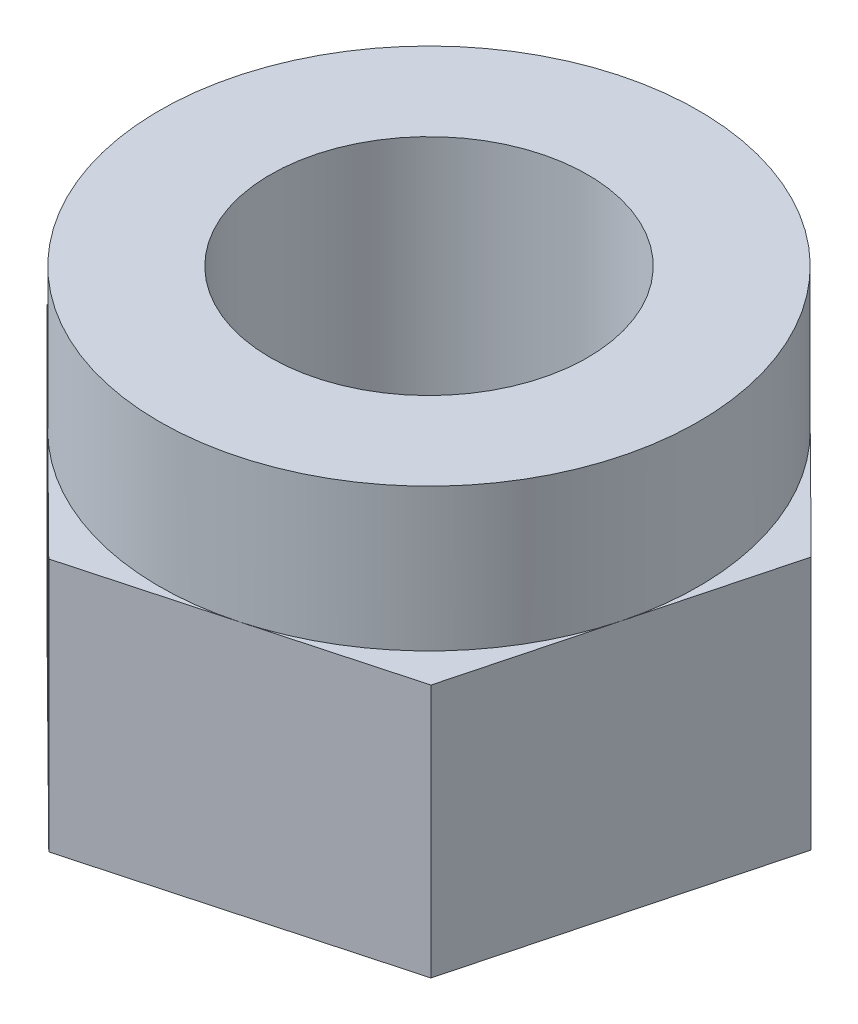
ISO-10303-21;
HEADER;
FILE_DESCRIPTION(('STEP AP214'),'2;1');
FILE_NAME('part.step','',(''),(''),'','','');
FILE_SCHEMA(('AUTOMOTIVE_DESIGN { 1 0 10303 214 1 1 1 1 }'));
ENDSEC;
DATA;
#1=APPLICATION_CONTEXT('core data for automotive mechanical design processes');
#2=APPLICATION_PROTOCOL_DEFINITION('international standard','automotive_design',2000,#1);
#3=PRODUCT_CONTEXT('',#1,'mechanical');
#4=PRODUCT('Part','Part','',(#3));
#5=PRODUCT_RELATED_PRODUCT_CATEGORY('part','',(#4));
#6=PRODUCT_DEFINITION_FORMATION('','',#4);
#7=PRODUCT_DEFINITION_CONTEXT('part definition',#1,'design');
#8=PRODUCT_DEFINITION('design','',#6,#7);
#9=PRODUCT_DEFINITION_SHAPE('','',#8);
#10=(LENGTH_UNIT() NAMED_UNIT(*) SI_UNIT(.MILLI.,.METRE.));
#11=(NAMED_UNIT(*) PLANE_ANGLE_UNIT() SI_UNIT($,.RADIAN.));
#12=(NAMED_UNIT(*) SI_UNIT($,.STERADIAN.) SOLID_ANGLE_UNIT());
#13=UNCERTAINTY_MEASURE_WITH_UNIT(LENGTH_MEASURE(1.E-05),#10,'distance_accuracy_value','');
#14=(GEOMETRIC_REPRESENTATION_CONTEXT(3) GLOBAL_UNCERTAINTY_ASSIGNED_CONTEXT((#13)) GLOBAL_UNIT_ASSIGNED_CONTEXT((#10,
#11,#12)) REPRESENTATION_CONTEXT('',''));
#15=CARTESIAN_POINT('',(0.,0.,0.));
#16=DIRECTION('',(0.,0.,1.));
#17=DIRECTION('',(1.,0.,0.));
#18=AXIS2_PLACEMENT_3D('',#15,#16,#17);
#19=CARTESIAN_POINT('',(0.,3.2,0.));
#20=DIRECTION('',(0.,1.,0.));
#21=DIRECTION('',(0.,0.,1.));
#22=AXIS2_PLACEMENT_3D('',#19,#20,#21);
#23=PLANE('',#22);
#24=DIRECTION('',(0.710289508724359,0.,0.70390966309329));
#25=VECTOR('',#24,1.);
#26=CARTESIAN_POINT('',(-2.39329285451718,3.2,2.41498432966281));
#27=LINE('',#26,#25);
#28=CARTESIAN_POINT('',(-3.78758470733673,3.2,1.03321605585771));
#29=VERTEX_POINT('',#28);
#30=CARTESIAN_POINT('',(-2.39329285451718,3.2,2.41498432966281));
#31=VERTEX_POINT('',#30);
#32=EDGE_CURVE('E113',#29,#31,#27,.T.);
#33=ORIENTED_EDGE('',*,*,#32,.T.);
#34=CARTESIAN_POINT('',(0.,3.2,0.));
#35=DIRECTION('',(0.,1.,0.));
#36=DIRECTION('',(0.,0.,1.));
#37=AXIS2_PLACEMENT_3D('',#34,#35,#36);
#38=CIRCLE('',#37,3.4);
#39=CARTESIAN_POINT('',(-3.28808420648792,3.2,-0.865160245876246));
#40=VERTEX_POINT('',#39);
#41=EDGE_CURVE('E51',#31,#40,#38,.F.);
#42=ORIENTED_EDGE('',*,*,#41,.T.);
#43=DIRECTION('',(-0.254458895845956,0.,0.967083590143508));
#44=VECTOR('',#43,1.);
#45=CARTESIAN_POINT('',(-3.28808420648792,3.2,-0.865160245876246));
#46=LINE('',#45,#44);
#47=EDGE_CURVE('E110',#40,#29,#46,.T.);
#48=ORIENTED_EDGE('',*,*,#47,.T.);
#49=EDGE_LOOP('',(#33,#42,#48));
#50=FACE_BOUND('',#49,.T.);
#51=ADVANCED_FACE('F36',(#50),#23,.T.);
#52=CARTESIAN_POINT('',(-2.7885837056391,3.2,-2.7635365476102));
#53=VERTEX_POINT('',#52);
#54=EDGE_CURVE('E117',#53,#40,#46,.T.);
#55=ORIENTED_EDGE('',*,*,#54,.T.);
#56=CARTESIAN_POINT('',(-0.894791351970739,3.2,-3.28014457553906));
#57=VERTEX_POINT('',#56);
#58=EDGE_CURVE('E187',#40,#57,#38,.F.);
#59=ORIENTED_EDGE('',*,*,#58,.T.);
#60=DIRECTION('',(-0.964748404570314,0.,0.263173927050218));
#61=VECTOR('',#60,1.);
#62=CARTESIAN_POINT('',(-0.894791351970738,3.2,-3.28014457553906));
#63=LINE('',#62,#61);
#64=EDGE_CURVE('E202',#57,#53,#63,.T.);
#65=ORIENTED_EDGE('',*,*,#64,.T.);
#66=EDGE_LOOP('',(#55,#59,#65));
#67=FACE_BOUND('',#66,.T.);
#68=ADVANCED_FACE('F204',(#67),#23,.T.);
#69=CARTESIAN_POINT('',(0.999001001697629,3.2,-3.79675260346791));
#70=VERTEX_POINT('',#69);
#71=EDGE_CURVE('E118',#70,#57,#63,.T.);
#72=ORIENTED_EDGE('',*,*,#71,.T.);
#73=CARTESIAN_POINT('',(2.39329285451718,3.2,-2.41498432966281));
#74=VERTEX_POINT('',#73);
#75=EDGE_CURVE('E185',#57,#74,#38,.F.);
#76=ORIENTED_EDGE('',*,*,#75,.T.);
#77=DIRECTION('',(-0.710289508724359,0.,-0.70390966309329));
#78=VECTOR('',#77,1.);
#79=CARTESIAN_POINT('',(2.39329285451718,3.2,-2.41498432966281));
#80=LINE('',#79,#78);
#81=EDGE_CURVE('E200',#74,#70,#80,.T.);
#82=ORIENTED_EDGE('',*,*,#81,.T.);
#83=EDGE_LOOP('',(#72,#76,#82));
#84=FACE_BOUND('',#83,.T.);
#85=ADVANCED_FACE('F206',(#84),#23,.T.);
#86=CARTESIAN_POINT('',(3.78758470733673,3.2,-1.03321605585771));
#87=VERTEX_POINT('',#86);
#88=EDGE_CURVE('E201',#87,#74,#80,.T.);
#89=ORIENTED_EDGE('',*,*,#88,.T.);
#90=CARTESIAN_POINT('',(3.28808420648792,3.2,0.865160245876247));
#91=VERTEX_POINT('',#90);
#92=EDGE_CURVE('E192',#74,#91,#38,.F.);
#93=ORIENTED_EDGE('',*,*,#92,.T.);
#94=DIRECTION('',(0.254458895845956,0.,-0.967083590143508));
#95=VECTOR('',#94,1.);
#96=CARTESIAN_POINT('',(3.28808420648792,3.2,0.865160245876247));
#97=LINE('',#96,#95);
#98=EDGE_CURVE('E97',#91,#87,#97,.T.);
#99=ORIENTED_EDGE('',*,*,#98,.T.);
#100=EDGE_LOOP('',(#89,#93,#99));
#101=FACE_BOUND('',#100,.T.);
#102=ADVANCED_FACE('F212',(#101),#23,.T.);
#103=CARTESIAN_POINT('',(2.78858370563911,3.2,2.76353654761021));
#104=VERTEX_POINT('',#103);
#105=EDGE_CURVE('E198',#104,#91,#97,.T.);
#106=ORIENTED_EDGE('',*,*,#105,.T.);
#107=CARTESIAN_POINT('',(0.89479135197074,3.2,3.28014457553906));
#108=VERTEX_POINT('',#107);
#109=EDGE_CURVE('E195',#91,#108,#38,.F.);
#110=ORIENTED_EDGE('',*,*,#109,.T.);
#111=DIRECTION('',(0.964748404570314,0.,-0.263173927050218));
#112=VECTOR('',#111,1.);
#113=CARTESIAN_POINT('',(0.89479135197074,3.2,3.28014457553906));
#114=LINE('',#113,#112);
#115=EDGE_CURVE('E60',#108,#104,#114,.T.);
#116=ORIENTED_EDGE('',*,*,#115,.T.);
#117=EDGE_LOOP('',(#106,#110,#116));
#118=FACE_BOUND('',#117,.T.);
#119=ADVANCED_FACE('F216',(#118),#23,.T.);
#120=CARTESIAN_POINT('',(3.28808420648792,3.2,0.865160245876247));
#121=DIRECTION('',(-0.967083590143508,0.,-0.254458895845955));
#122=DIRECTION('',(-0.254458895845956,0.,0.967083590143508));
#123=AXIS2_PLACEMENT_3D('',#120,#121,#122);
#124=PLANE('',#123);
#125=DIRECTION('',(0.254458895845956,0.,-0.967083590143508));
#126=VECTOR('',#125,1.);
#127=CARTESIAN_POINT('',(3.28808420648792,0.,0.865160245876247));
#128=LINE('',#127,#126);
#129=CARTESIAN_POINT('',(2.78858370563911,0.,2.76353654761021));
#130=VERTEX_POINT('',#129);
#131=CARTESIAN_POINT('',(3.78758470733673,0.,-1.03321605585771));
#132=VERTEX_POINT('',#131);
#133=EDGE_CURVE('E142',#130,#132,#128,.T.);
#134=ORIENTED_EDGE('',*,*,#133,.T.);
#135=DIRECTION('',(0.,-1.,0.));
#136=VECTOR('',#135,1.);
#137=CARTESIAN_POINT('',(3.78758470733673,3.2,-1.03321605585771));
#138=LINE('',#137,#136);
#139=EDGE_CURVE('E11',#87,#132,#138,.T.);
#140=ORIENTED_EDGE('',*,*,#139,.F.);
#141=ORIENTED_EDGE('',*,*,#98,.F.);
#142=ORIENTED_EDGE('',*,*,#105,.F.);
#143=DIRECTION('',(0.,-1.,0.));
#144=VECTOR('',#143,1.);
#145=CARTESIAN_POINT('',(2.78858370563911,3.2,2.76353654761021));
#146=LINE('',#145,#144);
#147=EDGE_CURVE('E141',#104,#130,#146,.T.);
#148=ORIENTED_EDGE('',*,*,#147,.T.);
#149=EDGE_LOOP('',(#134,#140,#141,#142,#148));
#150=FACE_BOUND('',#149,.T.);
#151=ADVANCED_FACE('F38',(#150),#124,.F.);
#152=CARTESIAN_POINT('',(2.39329285451718,3.2,-2.41498432966281));
#153=DIRECTION('',(-0.70390966309329,0.,0.710289508724359));
#154=DIRECTION('',(0.710289508724359,0.,0.70390966309329));
#155=AXIS2_PLACEMENT_3D('',#152,#153,#154);
#156=PLANE('',#155);
#157=DIRECTION('',(-0.710289508724359,0.,-0.70390966309329));
#158=VECTOR('',#157,1.);
#159=CARTESIAN_POINT('',(2.39329285451718,0.,-2.41498432966281));
#160=LINE('',#159,#158);
#161=CARTESIAN_POINT('',(0.999001001697629,0.,-3.79675260346791));
#162=VERTEX_POINT('',#161);
#163=EDGE_CURVE('E144',#132,#162,#160,.T.);
#164=ORIENTED_EDGE('',*,*,#163,.T.);
#165=DIRECTION('',(0.,-1.,0.));
#166=VECTOR('',#165,1.);
#167=CARTESIAN_POINT('',(0.999001001697629,3.2,-3.79675260346791));
#168=LINE('',#167,#166);
#169=EDGE_CURVE('E44',#70,#162,#168,.T.);
#170=ORIENTED_EDGE('',*,*,#169,.F.);
#171=ORIENTED_EDGE('',*,*,#81,.F.);
#172=ORIENTED_EDGE('',*,*,#88,.F.);
#173=ORIENTED_EDGE('',*,*,#139,.T.);
#174=EDGE_LOOP('',(#164,#170,#171,#172,#173));
#175=FACE_BOUND('',#174,.T.);
#176=ADVANCED_FACE('F228',(#175),#156,.F.);
#177=CARTESIAN_POINT('',(-0.894791351970738,3.2,-3.28014457553906));
#178=DIRECTION('',(0.263173927050218,0.,0.964748404570314));
#179=DIRECTION('',(0.964748404570314,0.,-0.263173927050218));
#180=AXIS2_PLACEMENT_3D('',#177,#178,#179);
#181=PLANE('',#180);
#182=DIRECTION('',(-0.964748404570314,0.,0.263173927050218));
#183=VECTOR('',#182,1.);
#184=CARTESIAN_POINT('',(-0.894791351970738,0.,-3.28014457553906));
#185=LINE('',#184,#183);
#186=CARTESIAN_POINT('',(-2.7885837056391,0.,-2.7635365476102));
#187=VERTEX_POINT('',#186);
#188=EDGE_CURVE('E146',#162,#187,#185,.T.);
#189=ORIENTED_EDGE('',*,*,#188,.T.);
#190=DIRECTION('',(0.,-1.,0.));
#191=VECTOR('',#190,1.);
#192=CARTESIAN_POINT('',(-2.7885837056391,3.2,-2.7635365476102));
#193=LINE('',#192,#191);
#194=EDGE_CURVE('E128',#53,#187,#193,.T.);
#195=ORIENTED_EDGE('',*,*,#194,.F.);
#196=ORIENTED_EDGE('',*,*,#64,.F.);
#197=ORIENTED_EDGE('',*,*,#71,.F.);
#198=ORIENTED_EDGE('',*,*,#169,.T.);
#199=EDGE_LOOP('',(#189,#195,#196,#197,#198));
#200=FACE_BOUND('',#199,.T.);
#201=ADVANCED_FACE('F159',(#200),#181,.F.);
#202=CARTESIAN_POINT('',(-3.28808420648792,3.2,-0.865160245876246));
#203=DIRECTION('',(0.967083590143508,0.,0.254458895845955));
#204=DIRECTION('',(0.254458895845956,0.,-0.967083590143508));
#205=AXIS2_PLACEMENT_3D('',#202,#203,#204);
#206=PLANE('',#205);
#207=DIRECTION('',(-0.254458895845956,0.,0.967083590143508));
#208=VECTOR('',#207,1.);
#209=CARTESIAN_POINT('',(-3.28808420648792,0.,-0.865160245876246));
#210=LINE('',#209,#208);
#211=CARTESIAN_POINT('',(-3.78758470733673,0.,1.03321605585771));
#212=VERTEX_POINT('',#211);
#213=EDGE_CURVE('E125',#187,#212,#210,.T.);
#214=ORIENTED_EDGE('',*,*,#213,.T.);
#215=DIRECTION('',(0.,-1.,0.));
#216=VECTOR('',#215,1.);
#217=CARTESIAN_POINT('',(-3.78758470733673,3.2,1.03321605585771));
#218=LINE('',#217,#216);
#219=EDGE_CURVE('E121',#29,#212,#218,.T.);
#220=ORIENTED_EDGE('',*,*,#219,.F.);
#221=ORIENTED_EDGE('',*,*,#47,.F.);
#222=ORIENTED_EDGE('',*,*,#54,.F.);
#223=ORIENTED_EDGE('',*,*,#194,.T.);
#224=EDGE_LOOP('',(#214,#220,#221,#222,#223));
#225=FACE_BOUND('',#224,.T.);
#226=ADVANCED_FACE('F122',(#225),#206,.F.);
#227=CARTESIAN_POINT('',(-2.39329285451718,3.2,2.41498432966281));
#228=DIRECTION('',(0.70390966309329,0.,-0.710289508724359));
#229=DIRECTION('',(-0.710289508724359,0.,-0.70390966309329));
#230=AXIS2_PLACEMENT_3D('',#227,#228,#229);
#231=PLANE('',#230);
#232=DIRECTION('',(0.710289508724359,0.,0.70390966309329));
#233=VECTOR('',#232,1.);
#234=CARTESIAN_POINT('',(-2.39329285451718,0.,2.41498432966281));
#235=LINE('',#234,#233);
#236=CARTESIAN_POINT('',(-0.999001001697624,0.,3.79675260346791));
#237=VERTEX_POINT('',#236);
#238=EDGE_CURVE('E149',#212,#237,#235,.T.);
#239=ORIENTED_EDGE('',*,*,#238,.T.);
#240=DIRECTION('',(0.,-1.,0.));
#241=VECTOR('',#240,1.);
#242=CARTESIAN_POINT('',(-0.999001001697624,3.2,3.79675260346791));
#243=LINE('',#242,#241);
#244=CARTESIAN_POINT('',(-0.999001001697624,3.2,3.79675260346791));
#245=VERTEX_POINT('',#244);
#246=EDGE_CURVE('E129',#245,#237,#243,.T.);
#247=ORIENTED_EDGE('',*,*,#246,.F.);
#248=EDGE_CURVE('E134',#31,#245,#27,.T.);
#249=ORIENTED_EDGE('',*,*,#248,.F.);
#250=ORIENTED_EDGE('',*,*,#32,.F.);
#251=ORIENTED_EDGE('',*,*,#219,.T.);
#252=EDGE_LOOP('',(#239,#247,#249,#250,#251));
#253=FACE_BOUND('',#252,.T.);
#254=ADVANCED_FACE('F132',(#253),#231,.F.);
#255=CARTESIAN_POINT('',(0.89479135197074,3.2,3.28014457553906));
#256=DIRECTION('',(-0.263173927050218,0.,-0.964748404570314));
#257=DIRECTION('',(-0.964748404570314,0.,0.263173927050218));
#258=AXIS2_PLACEMENT_3D('',#255,#256,#257);
#259=PLANE('',#258);
#260=DIRECTION('',(0.964748404570314,0.,-0.263173927050218));
#261=VECTOR('',#260,1.);
#262=CARTESIAN_POINT('',(0.89479135197074,0.,3.28014457553906));
#263=LINE('',#262,#261);
#264=EDGE_CURVE('E88',#237,#130,#263,.T.);
#265=ORIENTED_EDGE('',*,*,#264,.T.);
#266=ORIENTED_EDGE('',*,*,#147,.F.);
#267=ORIENTED_EDGE('',*,*,#115,.F.);
#268=EDGE_CURVE('E136',#245,#108,#114,.T.);
#269=ORIENTED_EDGE('',*,*,#268,.F.);
#270=ORIENTED_EDGE('',*,*,#246,.T.);
#271=EDGE_LOOP('',(#265,#266,#267,#269,#270));
#272=FACE_BOUND('',#271,.T.);
#273=ADVANCED_FACE('F170',(#272),#259,.F.);
#274=ORIENTED_EDGE('',*,*,#268,.T.);
#275=EDGE_CURVE('E174',#108,#31,#38,.F.);
#276=ORIENTED_EDGE('',*,*,#275,.T.);
#277=ORIENTED_EDGE('',*,*,#248,.T.);
#278=EDGE_LOOP('',(#274,#276,#277));
#279=FACE_BOUND('',#278,.T.);
#280=ADVANCED_FACE('F173',(#279),#23,.T.);
#281=CARTESIAN_POINT('',(0.,0.,0.));
#282=DIRECTION('',(0.,1.,0.));
#283=DIRECTION('',(0.,0.,1.));
#284=AXIS2_PLACEMENT_3D('',#281,#282,#283);
#285=PLANE('',#284);
#286=CARTESIAN_POINT('',(0.,0.,0.));
#287=DIRECTION('',(0.,1.,0.));
#288=DIRECTION('',(0.,0.,1.));
#289=AXIS2_PLACEMENT_3D('',#286,#287,#288);
#290=CIRCLE('',#289,2.);
#291=CARTESIAN_POINT('',(0.,0.,2.));
#292=VERTEX_POINT('',#291);
#293=EDGE_CURVE('E481',#292,#292,#290,.T.);
#294=ORIENTED_EDGE('',*,*,#293,.T.);
#295=EDGE_LOOP('',(#294));
#296=FACE_BOUND('',#295,.T.);
#297=ORIENTED_EDGE('',*,*,#264,.F.);
#298=ORIENTED_EDGE('',*,*,#238,.F.);
#299=ORIENTED_EDGE('',*,*,#213,.F.);
#300=ORIENTED_EDGE('',*,*,#188,.F.);
#301=ORIENTED_EDGE('',*,*,#163,.F.);
#302=ORIENTED_EDGE('',*,*,#133,.F.);
#303=EDGE_LOOP('',(#297,#298,#299,#300,#301,#302));
#304=FACE_BOUND('',#303,.T.);
#305=ADVANCED_FACE('F167',(#296,#304),#285,.F.);
#306=CARTESIAN_POINT('',(0.,5.,0.));
#307=DIRECTION('',(0.,-1.,0.));
#308=DIRECTION('',(0.,0.,-1.));
#309=AXIS2_PLACEMENT_3D('',#306,#307,#308);
#310=CYLINDRICAL_SURFACE('',#309,3.4);
#311=ORIENTED_EDGE('',*,*,#41,.F.);
#312=ORIENTED_EDGE('',*,*,#275,.F.);
#313=ORIENTED_EDGE('',*,*,#109,.F.);
#314=ORIENTED_EDGE('',*,*,#92,.F.);
#315=ORIENTED_EDGE('',*,*,#75,.F.);
#316=ORIENTED_EDGE('',*,*,#58,.F.);
#317=EDGE_LOOP('',(#311,#312,#313,#314,#315,#316));
#318=FACE_BOUND('',#317,.T.);
#319=CARTESIAN_POINT('',(0.,5.,0.));
#320=DIRECTION('',(0.,1.,0.));
#321=DIRECTION('',(0.,0.,1.));
#322=AXIS2_PLACEMENT_3D('',#319,#320,#321);
#323=CIRCLE('',#322,3.4);
#324=CARTESIAN_POINT('',(0.,5.,3.4));
#325=VERTEX_POINT('',#324);
#326=EDGE_CURVE('E196',#325,#325,#323,.T.);
#327=ORIENTED_EDGE('',*,*,#326,.F.);
#328=EDGE_LOOP('',(#327));
#329=FACE_BOUND('',#328,.T.);
#330=ADVANCED_FACE('F188',(#318,#329),#310,.T.);
#331=CARTESIAN_POINT('',(0.,5.,0.));
#332=DIRECTION('',(0.,1.,0.));
#333=DIRECTION('',(0.,0.,1.));
#334=AXIS2_PLACEMENT_3D('',#331,#332,#333);
#335=PLANE('',#334);
#336=CARTESIAN_POINT('',(0.,5.,0.));
#337=DIRECTION('',(0.,1.,0.));
#338=DIRECTION('',(0.,0.,1.));
#339=AXIS2_PLACEMENT_3D('',#336,#337,#338);
#340=CIRCLE('',#339,2.);
#341=CARTESIAN_POINT('',(0.,5.,2.));
#342=VERTEX_POINT('',#341);
#343=EDGE_CURVE('E478',#342,#342,#340,.T.);
#344=ORIENTED_EDGE('',*,*,#343,.F.);
#345=EDGE_LOOP('',(#344));
#346=FACE_BOUND('',#345,.T.);
#347=ORIENTED_EDGE('',*,*,#326,.T.);
#348=EDGE_LOOP('',(#347));
#349=FACE_BOUND('',#348,.T.);
#350=ADVANCED_FACE('F296',(#346,#349),#335,.T.);
#351=CARTESIAN_POINT('',(0.,5.,0.));
#352=DIRECTION('',(0.,-1.,0.));
#353=DIRECTION('',(0.,0.,-1.));
#354=AXIS2_PLACEMENT_3D('',#351,#352,#353);
#355=CYLINDRICAL_SURFACE('',#354,2.);
#356=ORIENTED_EDGE('',*,*,#343,.T.);
#357=EDGE_LOOP('',(#356));
#358=FACE_BOUND('',#357,.T.);
#359=ORIENTED_EDGE('',*,*,#293,.F.);
#360=EDGE_LOOP('',(#359));
#361=FACE_BOUND('',#360,.T.);
#362=ADVANCED_FACE('F303',(#358,#361),#355,.F.);
#363=CLOSED_SHELL('',(#51,#68,#85,#102,#119,#151,#176,#201,#226,#254,#273,#280,#305,#330,#350,#362));
#364=MANIFOLD_SOLID_BREP('B2',#363);
#365=ADVANCED_BREP_SHAPE_REPRESENTATION('',(#18,#364),#14);
#366=SHAPE_DEFINITION_REPRESENTATION(#9,#365);
ENDSEC;
END-ISO-10303-21;
